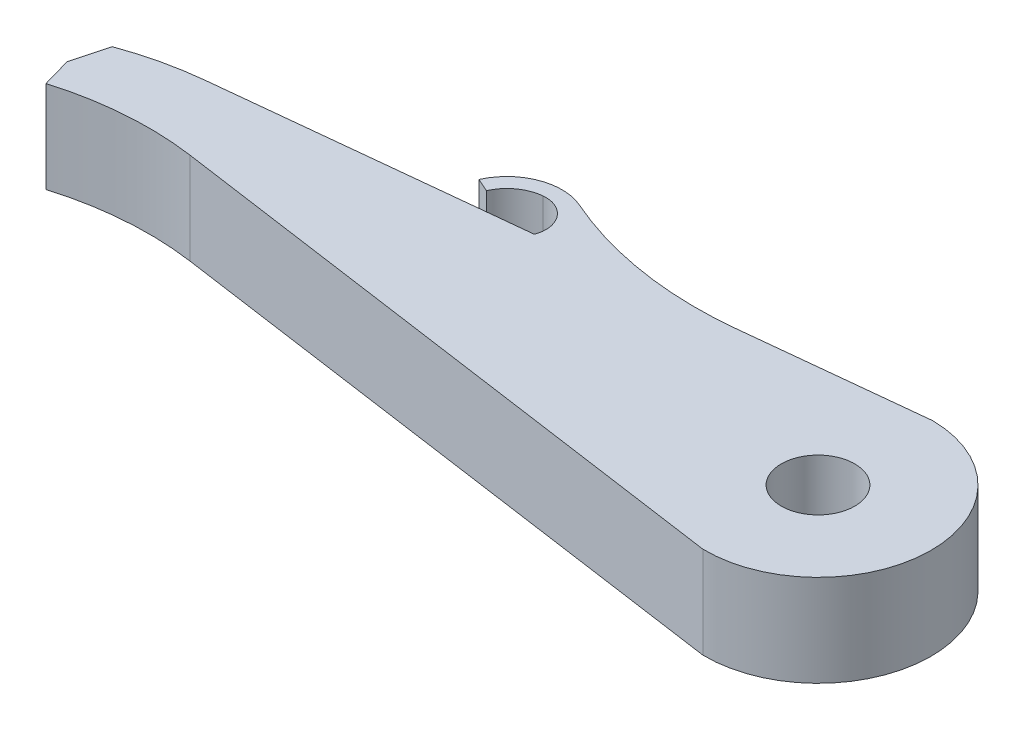
ISO-10303-21;
HEADER;
FILE_DESCRIPTION(('STEP AP214'),'2;1');
FILE_NAME('part.step','',(''),(''),'','','');
FILE_SCHEMA(('AUTOMOTIVE_DESIGN { 1 0 10303 214 1 1 1 1 }'));
ENDSEC;
DATA;
#1=APPLICATION_CONTEXT('core data for automotive mechanical design processes');
#2=APPLICATION_PROTOCOL_DEFINITION('international standard','automotive_design',2000,#1);
#3=PRODUCT_CONTEXT('',#1,'mechanical');
#4=PRODUCT('Part','Part','',(#3));
#5=PRODUCT_RELATED_PRODUCT_CATEGORY('part','',(#4));
#6=PRODUCT_DEFINITION_FORMATION('','',#4);
#7=PRODUCT_DEFINITION_CONTEXT('part definition',#1,'design');
#8=PRODUCT_DEFINITION('design','',#6,#7);
#9=PRODUCT_DEFINITION_SHAPE('','',#8);
#10=(LENGTH_UNIT() NAMED_UNIT(*) SI_UNIT(.MILLI.,.METRE.));
#11=(NAMED_UNIT(*) PLANE_ANGLE_UNIT() SI_UNIT($,.RADIAN.));
#12=(NAMED_UNIT(*) SI_UNIT($,.STERADIAN.) SOLID_ANGLE_UNIT());
#13=UNCERTAINTY_MEASURE_WITH_UNIT(LENGTH_MEASURE(1.E-05),#10,'distance_accuracy_value','');
#14=(GEOMETRIC_REPRESENTATION_CONTEXT(3) GLOBAL_UNCERTAINTY_ASSIGNED_CONTEXT((#13)) GLOBAL_UNIT_ASSIGNED_CONTEXT((#10,
#11,#12)) REPRESENTATION_CONTEXT('',''));
#15=CARTESIAN_POINT('',(0.,0.,0.));
#16=DIRECTION('',(0.,0.,1.));
#17=DIRECTION('',(1.,0.,0.));
#18=AXIS2_PLACEMENT_3D('',#15,#16,#17);
#19=CARTESIAN_POINT('',(8.06960821075852,2.5,-18.1095067362773));
#20=DIRECTION('',(-0.40702018513425,0.,0.913419163852654));
#21=DIRECTION('',(0.913419163852654,0.,0.40702018513425));
#22=AXIS2_PLACEMENT_3D('',#19,#20,#21);
#23=PLANE('',#22);
#24=DIRECTION('',(-0.913419163852653,0.,-0.40702018513425));
#25=VECTOR('',#24,1.);
#26=CARTESIAN_POINT('',(8.06960821075852,0.,-18.1095067362773));
#27=LINE('',#26,#25);
#28=CARTESIAN_POINT('',(12.3776456719996,0.,-16.1898423867318));
#29=VERTEX_POINT('',#28);
#30=CARTESIAN_POINT('',(12.0122780064586,0.,-16.3526504607855));
#31=VERTEX_POINT('',#30);
#32=EDGE_CURVE('E226',#29,#31,#27,.T.);
#33=ORIENTED_EDGE('',*,*,#32,.F.);
#34=DIRECTION('',(0.,-1.,0.));
#35=VECTOR('',#34,1.);
#36=CARTESIAN_POINT('',(12.3776456719996,2.5,-16.1898423867318));
#37=LINE('',#36,#35);
#38=CARTESIAN_POINT('',(12.3776456719996,2.5,-16.1898423867318));
#39=VERTEX_POINT('',#38);
#40=EDGE_CURVE('E172',#39,#29,#37,.T.);
#41=ORIENTED_EDGE('',*,*,#40,.F.);
#42=DIRECTION('',(-0.913419163852653,0.,-0.40702018513425));
#43=VECTOR('',#42,1.);
#44=CARTESIAN_POINT('',(8.06960821075852,2.5,-18.1095067362773));
#45=LINE('',#44,#43);
#46=CARTESIAN_POINT('',(12.0122780064586,2.5,-16.3526504607855));
#47=VERTEX_POINT('',#46);
#48=EDGE_CURVE('E201',#39,#47,#45,.T.);
#49=ORIENTED_EDGE('',*,*,#48,.T.);
#50=DIRECTION('',(0.,-1.,0.));
#51=VECTOR('',#50,1.);
#52=CARTESIAN_POINT('',(12.0122780064586,2.5,-16.3526504607855));
#53=LINE('',#52,#51);
#54=EDGE_CURVE('E194',#47,#31,#53,.T.);
#55=ORIENTED_EDGE('',*,*,#54,.T.);
#56=EDGE_LOOP('',(#33,#41,#49,#55));
#57=FACE_BOUND('',#56,.T.);
#58=ADVANCED_FACE('F37',(#57),#23,.T.);
#59=CARTESIAN_POINT('',(13.3824067522375,2.5,-15.7421201830844));
#60=DIRECTION('',(0.,-1.,0.));
#61=DIRECTION('',(0.,0.,-1.));
#62=AXIS2_PLACEMENT_3D('',#59,#60,#61);
#63=CYLINDRICAL_SURFACE('',#62,1.09999999999993);
#64=CARTESIAN_POINT('',(13.3824067522375,0.,-15.7421201830844));
#65=DIRECTION('',(0.,1.,0.));
#66=DIRECTION('',(0.,0.,1.));
#67=AXIS2_PLACEMENT_3D('',#64,#65,#66);
#68=CIRCLE('',#67,1.09999999999993);
#69=CARTESIAN_POINT('',(13.2677650143158,0.,-16.8361299051282));
#70=VERTEX_POINT('',#69);
#71=EDGE_CURVE('E224',#29,#70,#68,.F.);
#72=ORIENTED_EDGE('',*,*,#71,.T.);
#73=DIRECTION('',(0.,-1.,0.));
#74=VECTOR('',#73,1.);
#75=CARTESIAN_POINT('',(13.2677650143158,2.5,-16.8361299051282));
#76=LINE('',#75,#74);
#77=CARTESIAN_POINT('',(13.2677650143158,2.5,-16.8361299051282));
#78=VERTEX_POINT('',#77);
#79=EDGE_CURVE('E175',#78,#70,#76,.T.);
#80=ORIENTED_EDGE('',*,*,#79,.F.);
#81=CARTESIAN_POINT('',(13.3824067522375,2.5,-15.7421201830844));
#82=DIRECTION('',(0.,1.,0.));
#83=DIRECTION('',(0.,0.,1.));
#84=AXIS2_PLACEMENT_3D('',#81,#82,#83);
#85=CIRCLE('',#84,1.09999999999993);
#86=EDGE_CURVE('E244',#39,#78,#85,.F.);
#87=ORIENTED_EDGE('',*,*,#86,.F.);
#88=ORIENTED_EDGE('',*,*,#40,.T.);
#89=EDGE_LOOP('',(#72,#80,#87,#88));
#90=FACE_BOUND('',#89,.T.);
#91=ADVANCED_FACE('F269',(#90),#63,.F.);
#92=CARTESIAN_POINT('',(13.3469720332435,2.5,-16.0802686426252));
#93=DIRECTION('',(0.,-1.,0.));
#94=DIRECTION('',(0.,0.,-1.));
#95=AXIS2_PLACEMENT_3D('',#92,#93,#94);
#96=CYLINDRICAL_SURFACE('',#95,0.759999999999999);
#97=CARTESIAN_POINT('',(13.3469720332435,0.,-16.0802686426252));
#98=DIRECTION('',(0.,1.,0.));
#99=DIRECTION('',(0.,0.,1.));
#100=AXIS2_PLACEMENT_3D('',#97,#98,#99);
#101=CIRCLE('',#100,0.759999999999999);
#102=CARTESIAN_POINT('',(14.0584110920629,0.,-15.8129589615691));
#103=VERTEX_POINT('',#102);
#104=EDGE_CURVE('E221',#103,#70,#101,.T.);
#105=ORIENTED_EDGE('',*,*,#104,.F.);
#106=DIRECTION('',(0.,-1.,0.));
#107=VECTOR('',#106,1.);
#108=CARTESIAN_POINT('',(14.0584110920629,2.5,-15.8129589615691));
#109=LINE('',#108,#107);
#110=CARTESIAN_POINT('',(14.0584110920629,2.5,-15.8129589615691));
#111=VERTEX_POINT('',#110);
#112=EDGE_CURVE('E180',#111,#103,#109,.T.);
#113=ORIENTED_EDGE('',*,*,#112,.F.);
#114=CARTESIAN_POINT('',(13.3469720332435,2.5,-16.0802686426252));
#115=DIRECTION('',(0.,1.,0.));
#116=DIRECTION('',(0.,0.,1.));
#117=AXIS2_PLACEMENT_3D('',#114,#115,#116);
#118=CIRCLE('',#117,0.759999999999999);
#119=EDGE_CURVE('E241',#111,#78,#118,.T.);
#120=ORIENTED_EDGE('',*,*,#119,.T.);
#121=ORIENTED_EDGE('',*,*,#79,.T.);
#122=EDGE_LOOP('',(#105,#113,#120,#121));
#123=FACE_BOUND('',#122,.T.);
#124=ADVANCED_FACE('F266',(#123),#96,.F.);
#125=CARTESIAN_POINT('',(-1.48634909619356,2.5,-14.1840170174072));
#126=DIRECTION('',(-0.104219761747012,0.,-0.994554292767065));
#127=DIRECTION('',(-0.994554292767065,0.,0.104219761747012));
#128=AXIS2_PLACEMENT_3D('',#125,#126,#127);
#129=PLANE('',#128);
#130=DIRECTION('',(0.994554292767065,0.,-0.104219761747012));
#131=VECTOR('',#130,1.);
#132=CARTESIAN_POINT('',(-1.48634909619356,0.,-14.1840170174072));
#133=LINE('',#132,#131);
#134=CARTESIAN_POINT('',(5.92324955648456,0.,-14.9604719699816));
#135=VERTEX_POINT('',#134);
#136=EDGE_CURVE('E218',#135,#103,#133,.T.);
#137=ORIENTED_EDGE('',*,*,#136,.F.);
#138=DIRECTION('',(0.,-1.,0.));
#139=VECTOR('',#138,1.);
#140=CARTESIAN_POINT('',(5.92324955648456,2.5,-14.9604719699816));
#141=LINE('',#140,#139);
#142=CARTESIAN_POINT('',(5.92324955648456,2.5,-14.9604719699816));
#143=VERTEX_POINT('',#142);
#144=EDGE_CURVE('E184',#143,#135,#141,.T.);
#145=ORIENTED_EDGE('',*,*,#144,.F.);
#146=DIRECTION('',(0.994554292767065,0.,-0.104219761747012));
#147=VECTOR('',#146,1.);
#148=CARTESIAN_POINT('',(-1.48634909619356,2.5,-14.1840170174072));
#149=LINE('',#148,#147);
#150=EDGE_CURVE('E238',#143,#111,#149,.T.);
#151=ORIENTED_EDGE('',*,*,#150,.T.);
#152=ORIENTED_EDGE('',*,*,#112,.T.);
#153=EDGE_LOOP('',(#137,#145,#151,#152));
#154=FACE_BOUND('',#153,.T.);
#155=ADVANCED_FACE('F262',(#154),#129,.T.);
#156=CARTESIAN_POINT('',(6.81535807850737,2.5,-6.44720783159745));
#157=DIRECTION('',(0.,-1.,0.));
#158=DIRECTION('',(0.,0.,-1.));
#159=AXIS2_PLACEMENT_3D('',#156,#157,#158);
#160=CYLINDRICAL_SURFACE('',#159,8.55987873190752);
#161=CARTESIAN_POINT('',(6.81535807850737,0.,-6.44720783159745));
#162=DIRECTION('',(0.,1.,0.));
#163=DIRECTION('',(0.,0.,1.));
#164=AXIS2_PLACEMENT_3D('',#161,#162,#163);
#165=CIRCLE('',#164,8.55987873190752);
#166=CARTESIAN_POINT('',(3.88228567653783,0.,-14.488887394336));
#167=VERTEX_POINT('',#166);
#168=EDGE_CURVE('E215',#167,#135,#165,.F.);
#169=ORIENTED_EDGE('',*,*,#168,.F.);
#170=DIRECTION('',(0.,-1.,0.));
#171=VECTOR('',#170,1.);
#172=CARTESIAN_POINT('',(3.88228567653783,2.5,-14.488887394336));
#173=LINE('',#172,#171);
#174=CARTESIAN_POINT('',(3.88228567653783,2.5,-14.488887394336));
#175=VERTEX_POINT('',#174);
#176=EDGE_CURVE('E186',#175,#167,#173,.T.);
#177=ORIENTED_EDGE('',*,*,#176,.F.);
#178=CARTESIAN_POINT('',(6.81535807850737,2.5,-6.44720783159745));
#179=DIRECTION('',(0.,1.,0.));
#180=DIRECTION('',(0.,0.,1.));
#181=AXIS2_PLACEMENT_3D('',#178,#179,#180);
#182=CIRCLE('',#181,8.55987873190752);
#183=EDGE_CURVE('E159',#175,#143,#182,.F.);
#184=ORIENTED_EDGE('',*,*,#183,.T.);
#185=ORIENTED_EDGE('',*,*,#144,.T.);
#186=EDGE_LOOP('',(#169,#177,#184,#185));
#187=FACE_BOUND('',#186,.T.);
#188=ADVANCED_FACE('F258',(#187),#160,.T.);
#189=CARTESIAN_POINT('',(0.,2.5,0.));
#190=DIRECTION('',(0.965925826289068,0.,0.258819045102522));
#191=DIRECTION('',(0.258819045102522,0.,-0.965925826289068));
#192=AXIS2_PLACEMENT_3D('',#189,#190,#191);
#193=PLANE('',#192);
#194=DIRECTION('',(-0.258819045102522,0.,0.965925826289068));
#195=VECTOR('',#194,1.);
#196=CARTESIAN_POINT('',(0.,0.,0.));
#197=LINE('',#196,#195);
#198=CARTESIAN_POINT('',(3.6234666314353,0.,-13.522961568047));
#199=VERTEX_POINT('',#198);
#200=EDGE_CURVE('E213',#167,#199,#197,.T.);
#201=ORIENTED_EDGE('',*,*,#200,.T.);
#202=DIRECTION('',(0.,1.,0.));
#203=VECTOR('',#202,1.);
#204=CARTESIAN_POINT('',(3.6234666314353,-7.5,-13.522961568047));
#205=LINE('',#204,#203);
#206=CARTESIAN_POINT('',(3.6234666314353,2.5,-13.522961568047));
#207=VERTEX_POINT('',#206);
#208=EDGE_CURVE('E139',#199,#207,#205,.T.);
#209=ORIENTED_EDGE('',*,*,#208,.T.);
#210=DIRECTION('',(-0.258819045102522,0.,0.965925826289068));
#211=VECTOR('',#210,1.);
#212=CARTESIAN_POINT('',(0.,2.5,0.));
#213=LINE('',#212,#211);
#214=EDGE_CURVE('E149',#175,#207,#213,.T.);
#215=ORIENTED_EDGE('',*,*,#214,.F.);
#216=ORIENTED_EDGE('',*,*,#176,.T.);
#217=EDGE_LOOP('',(#201,#209,#215,#216));
#218=FACE_BOUND('',#217,.T.);
#219=ADVANCED_FACE('F253',(#218),#193,.F.);
#220=CARTESIAN_POINT('',(6.29771998830233,2.5,-4.51535617901932));
#221=DIRECTION('',(0.,-1.,0.));
#222=DIRECTION('',(0.,0.,-1.));
#223=AXIS2_PLACEMENT_3D('',#220,#221,#222);
#224=CYLINDRICAL_SURFACE('',#223,8.55987873190751);
#225=CARTESIAN_POINT('',(6.29771998830233,2.5,-4.51535617901932));
#226=DIRECTION('',(0.,1.,0.));
#227=DIRECTION('',(0.,0.,1.));
#228=AXIS2_PLACEMENT_3D('',#225,#226,#227);
#229=CIRCLE('',#228,8.55987873190751);
#230=CARTESIAN_POINT('',(3.8519480644686,2.5,-12.718387545627));
#231=VERTEX_POINT('',#230);
#232=CARTESIAN_POINT('',(7.50000000000002,2.5,-12.9903810567666));
#233=VERTEX_POINT('',#232);
#234=EDGE_CURVE('E145',#231,#233,#229,.F.);
#235=ORIENTED_EDGE('',*,*,#234,.F.);
#236=DIRECTION('',(0.,1.,0.));
#237=VECTOR('',#236,1.);
#238=CARTESIAN_POINT('',(3.8519480644686,-7.5,-12.718387545627));
#239=LINE('',#238,#237);
#240=CARTESIAN_POINT('',(3.8519480644686,0.,-12.718387545627));
#241=VERTEX_POINT('',#240);
#242=EDGE_CURVE('E129',#241,#231,#239,.T.);
#243=ORIENTED_EDGE('',*,*,#242,.F.);
#244=CARTESIAN_POINT('',(6.29771998830233,0.,-4.51535617901932));
#245=DIRECTION('',(0.,1.,0.));
#246=DIRECTION('',(0.,0.,1.));
#247=AXIS2_PLACEMENT_3D('',#244,#245,#246);
#248=CIRCLE('',#247,8.55987873190751);
#249=CARTESIAN_POINT('',(7.50000000000002,0.,-12.9903810567666));
#250=VERTEX_POINT('',#249);
#251=EDGE_CURVE('E211',#241,#250,#248,.F.);
#252=ORIENTED_EDGE('',*,*,#251,.T.);
#253=DIRECTION('',(0.,-1.,0.));
#254=VECTOR('',#253,1.);
#255=CARTESIAN_POINT('',(7.50000000000002,2.5,-12.9903810567666));
#256=LINE('',#255,#254);
#257=EDGE_CURVE('E153',#233,#250,#256,.T.);
#258=ORIENTED_EDGE('',*,*,#257,.F.);
#259=EDGE_LOOP('',(#235,#243,#252,#258));
#260=FACE_BOUND('',#259,.T.);
#261=ADVANCED_FACE('F151',(#260),#224,.F.);
#262=CARTESIAN_POINT('',(1.95443809378865,2.5,-13.7770829637989));
#263=DIRECTION('',(0.140455262200863,0.,-0.990087026134616));
#264=DIRECTION('',(-0.990087026134616,0.,-0.140455262200863));
#265=AXIS2_PLACEMENT_3D('',#262,#263,#264);
#266=PLANE('',#265);
#267=DIRECTION('',(0.990087026134616,0.,0.140455262200863));
#268=VECTOR('',#267,1.);
#269=CARTESIAN_POINT('',(1.95443809378865,0.,-13.7770829637989));
#270=LINE('',#269,#268);
#271=CARTESIAN_POINT('',(23.7805143183467,0.,-10.6808023561187));
#272=VERTEX_POINT('',#271);
#273=EDGE_CURVE('E208',#250,#272,#270,.T.);
#274=ORIENTED_EDGE('',*,*,#273,.T.);
#275=DIRECTION('',(0.,-1.,0.));
#276=VECTOR('',#275,1.);
#277=CARTESIAN_POINT('',(23.7805143183467,2.5,-10.6808023561187));
#278=LINE('',#277,#276);
#279=CARTESIAN_POINT('',(23.7805143183467,2.5,-10.6808023561187));
#280=VERTEX_POINT('',#279);
#281=EDGE_CURVE('E189',#280,#272,#278,.T.);
#282=ORIENTED_EDGE('',*,*,#281,.F.);
#283=DIRECTION('',(0.990087026134616,0.,0.140455262200863));
#284=VECTOR('',#283,1.);
#285=CARTESIAN_POINT('',(1.95443809378865,2.5,-13.7770829637989));
#286=LINE('',#285,#284);
#287=EDGE_CURVE('E155',#233,#280,#286,.T.);
#288=ORIENTED_EDGE('',*,*,#287,.F.);
#289=ORIENTED_EDGE('',*,*,#257,.T.);
#290=EDGE_LOOP('',(#274,#282,#288,#289));
#291=FACE_BOUND('',#290,.T.);
#292=ADVANCED_FACE('F285',(#291),#266,.F.);
#293=CARTESIAN_POINT('',(23.836773762309,2.5,-13.7621677482813));
#294=DIRECTION('',(0.,-1.,0.));
#295=DIRECTION('',(0.,0.,-1.));
#296=AXIS2_PLACEMENT_3D('',#293,#294,#295);
#297=CYLINDRICAL_SURFACE('',#296,3.08187894068731);
#298=CARTESIAN_POINT('',(23.836773762309,0.,-13.7621677482813));
#299=DIRECTION('',(0.,1.,0.));
#300=DIRECTION('',(0.,0.,1.));
#301=AXIS2_PLACEMENT_3D('',#298,#299,#300);
#302=CIRCLE('',#301,3.08187894068731);
#303=CARTESIAN_POINT('',(23.8930332062714,0.,-16.8435331404438));
#304=VERTEX_POINT('',#303);
#305=EDGE_CURVE('E205',#304,#272,#302,.F.);
#306=ORIENTED_EDGE('',*,*,#305,.F.);
#307=DIRECTION('',(0.,-1.,0.));
#308=VECTOR('',#307,1.);
#309=CARTESIAN_POINT('',(23.8930332062714,2.5,-16.8435331404438));
#310=LINE('',#309,#308);
#311=CARTESIAN_POINT('',(23.8930332062714,2.5,-16.8435331404438));
#312=VERTEX_POINT('',#311);
#313=EDGE_CURVE('E191',#312,#304,#310,.T.);
#314=ORIENTED_EDGE('',*,*,#313,.F.);
#315=CARTESIAN_POINT('',(23.836773762309,2.5,-13.7621677482813));
#316=DIRECTION('',(0.,1.,0.));
#317=DIRECTION('',(0.,0.,1.));
#318=AXIS2_PLACEMENT_3D('',#315,#316,#317);
#319=CIRCLE('',#318,3.08187894068731);
#320=EDGE_CURVE('E157',#312,#280,#319,.F.);
#321=ORIENTED_EDGE('',*,*,#320,.T.);
#322=ORIENTED_EDGE('',*,*,#281,.T.);
#323=EDGE_LOOP('',(#306,#314,#321,#322));
#324=FACE_BOUND('',#323,.T.);
#325=ADVANCED_FACE('F288',(#324),#297,.T.);
#326=CARTESIAN_POINT('',(19.0303894257842,0.,-16.3339746578667));
#327=VERTEX_POINT('',#326);
#328=EDGE_CURVE('E204',#327,#304,#133,.T.);
#329=ORIENTED_EDGE('',*,*,#328,.F.);
#330=DIRECTION('',(0.,-1.,0.));
#331=VECTOR('',#330,1.);
#332=CARTESIAN_POINT('',(19.0303894257842,2.5,-16.3339746578666));
#333=LINE('',#332,#331);
#334=CARTESIAN_POINT('',(19.0303894257842,2.5,-16.3339746578667));
#335=VERTEX_POINT('',#334);
#336=EDGE_CURVE('E52',#327,#335,#333,.F.);
#337=ORIENTED_EDGE('',*,*,#336,.T.);
#338=EDGE_CURVE('E233',#335,#312,#149,.T.);
#339=ORIENTED_EDGE('',*,*,#338,.T.);
#340=ORIENTED_EDGE('',*,*,#313,.T.);
#341=EDGE_LOOP('',(#329,#337,#339,#340));
#342=FACE_BOUND('',#341,.T.);
#343=ADVANCED_FACE('F292',(#342),#129,.T.);
#344=CARTESIAN_POINT('',(13.3824067522375,2.5,-15.7421201830844));
#345=DIRECTION('',(0.,-1.,0.));
#346=DIRECTION('',(0.,0.,-1.));
#347=AXIS2_PLACEMENT_3D('',#344,#345,#346);
#348=CYLINDRICAL_SURFACE('',#347,1.49999999999993);
#349=CARTESIAN_POINT('',(13.3824067522375,2.5,-15.7421201830844));
#350=DIRECTION('',(0.,1.,0.));
#351=DIRECTION('',(0.,0.,1.));
#352=AXIS2_PLACEMENT_3D('',#349,#350,#351);
#353=CIRCLE('',#352,1.49999999999993);
#354=CARTESIAN_POINT('',(13.9831613247692,2.5,-17.1165633225348));
#355=VERTEX_POINT('',#354);
#356=EDGE_CURVE('E231',#355,#47,#353,.T.);
#357=ORIENTED_EDGE('',*,*,#356,.F.);
#358=DIRECTION('',(0.,-1.,0.));
#359=VECTOR('',#358,1.);
#360=CARTESIAN_POINT('',(13.9831613247692,2.5,-17.1165633225348));
#361=LINE('',#360,#359);
#362=CARTESIAN_POINT('',(13.9831613247692,0.,-17.1165633225348));
#363=VERTEX_POINT('',#362);
#364=EDGE_CURVE('E166',#355,#363,#361,.T.);
#365=ORIENTED_EDGE('',*,*,#364,.T.);
#366=CARTESIAN_POINT('',(13.3824067522375,0.,-15.7421201830844));
#367=DIRECTION('',(0.,1.,0.));
#368=DIRECTION('',(0.,0.,1.));
#369=AXIS2_PLACEMENT_3D('',#366,#367,#368);
#370=CIRCLE('',#369,1.49999999999993);
#371=EDGE_CURVE('E202',#363,#31,#370,.T.);
#372=ORIENTED_EDGE('',*,*,#371,.T.);
#373=ORIENTED_EDGE('',*,*,#54,.F.);
#374=EDGE_LOOP('',(#357,#365,#372,#373));
#375=FACE_BOUND('',#374,.T.);
#376=ADVANCED_FACE('F296',(#375),#348,.T.);
#377=CARTESIAN_POINT('',(23.836773762309,2.5,-13.7621677482813));
#378=DIRECTION('',(0.,-1.,0.));
#379=DIRECTION('',(0.,0.,-1.));
#380=AXIS2_PLACEMENT_3D('',#377,#378,#379);
#381=CYLINDRICAL_SURFACE('',#380,0.999999999999998);
#382=CARTESIAN_POINT('',(23.836773762309,2.5,-13.7621677482813));
#383=DIRECTION('',(0.,1.,0.));
#384=DIRECTION('',(0.,0.,1.));
#385=AXIS2_PLACEMENT_3D('',#382,#383,#384);
#386=CIRCLE('',#385,0.999999999999998);
#387=CARTESIAN_POINT('',(23.836773762309,2.5,-12.7621677482813));
#388=VERTEX_POINT('',#387);
#389=EDGE_CURVE('E197',#388,#388,#386,.T.);
#390=ORIENTED_EDGE('',*,*,#389,.T.);
#391=EDGE_LOOP('',(#390));
#392=FACE_BOUND('',#391,.T.);
#393=CARTESIAN_POINT('',(23.836773762309,0.,-13.7621677482813));
#394=DIRECTION('',(0.,1.,0.));
#395=DIRECTION('',(0.,0.,1.));
#396=AXIS2_PLACEMENT_3D('',#393,#394,#395);
#397=CIRCLE('',#396,0.999999999999998);
#398=CARTESIAN_POINT('',(23.836773762309,0.,-12.7621677482813));
#399=VERTEX_POINT('',#398);
#400=EDGE_CURVE('E198',#399,#399,#397,.T.);
#401=ORIENTED_EDGE('',*,*,#400,.F.);
#402=EDGE_LOOP('',(#401));
#403=FACE_BOUND('',#402,.T.);
#404=ADVANCED_FACE('F299',(#392,#403),#381,.F.);
#405=CARTESIAN_POINT('',(0.,2.5,0.));
#406=DIRECTION('',(0.,1.,0.));
#407=DIRECTION('',(0.,0.,1.));
#408=AXIS2_PLACEMENT_3D('',#405,#406,#407);
#409=PLANE('',#408);
#410=DIRECTION('',(-0.273176708736756,0.,-0.961963869281874));
#411=VECTOR('',#410,1.);
#412=CARTESIAN_POINT('',(3.6234666314353,2.5,-13.522961568047));
#413=LINE('',#412,#411);
#414=EDGE_CURVE('E132',#231,#207,#413,.T.);
#415=ORIENTED_EDGE('',*,*,#414,.F.);
#416=ORIENTED_EDGE('',*,*,#234,.T.);
#417=ORIENTED_EDGE('',*,*,#287,.T.);
#418=ORIENTED_EDGE('',*,*,#320,.F.);
#419=ORIENTED_EDGE('',*,*,#338,.F.);
#420=CARTESIAN_POINT('',(17.9881918083141,2.5,-26.2795175855373));
#421=DIRECTION('',(0.,1.,0.));
#422=DIRECTION('',(0.,0.,1.));
#423=AXIS2_PLACEMENT_3D('',#420,#421,#422);
#424=CIRCLE('',#423,10.);
#425=EDGE_CURVE('E11',#335,#355,#424,.F.);
#426=ORIENTED_EDGE('',*,*,#425,.T.);
#427=ORIENTED_EDGE('',*,*,#356,.T.);
#428=ORIENTED_EDGE('',*,*,#48,.F.);
#429=ORIENTED_EDGE('',*,*,#86,.T.);
#430=ORIENTED_EDGE('',*,*,#119,.F.);
#431=ORIENTED_EDGE('',*,*,#150,.F.);
#432=ORIENTED_EDGE('',*,*,#183,.F.);
#433=ORIENTED_EDGE('',*,*,#214,.T.);
#434=EDGE_LOOP('',(#415,#416,#417,#418,#419,#426,#427,#428,#429,#430,#431,#432,#433));
#435=FACE_BOUND('',#434,.T.);
#436=ORIENTED_EDGE('',*,*,#389,.F.);
#437=EDGE_LOOP('',(#436));
#438=FACE_BOUND('',#437,.T.);
#439=ADVANCED_FACE('F143',(#435,#438),#409,.T.);
#440=CARTESIAN_POINT('',(0.,0.,0.));
#441=DIRECTION('',(0.,1.,0.));
#442=DIRECTION('',(0.,0.,1.));
#443=AXIS2_PLACEMENT_3D('',#440,#441,#442);
#444=PLANE('',#443);
#445=ORIENTED_EDGE('',*,*,#251,.F.);
#446=DIRECTION('',(-0.273176708736756,0.,-0.961963869281874));
#447=VECTOR('',#446,1.);
#448=CARTESIAN_POINT('',(6.90671022276373,0.,-1.96135471102631));
#449=LINE('',#448,#447);
#450=EDGE_CURVE('E135',#241,#199,#449,.T.);
#451=ORIENTED_EDGE('',*,*,#450,.T.);
#452=ORIENTED_EDGE('',*,*,#200,.F.);
#453=ORIENTED_EDGE('',*,*,#168,.T.);
#454=ORIENTED_EDGE('',*,*,#136,.T.);
#455=ORIENTED_EDGE('',*,*,#104,.T.);
#456=ORIENTED_EDGE('',*,*,#71,.F.);
#457=ORIENTED_EDGE('',*,*,#32,.T.);
#458=ORIENTED_EDGE('',*,*,#371,.F.);
#459=CARTESIAN_POINT('',(17.9881918083141,0.,-26.2795175855373));
#460=DIRECTION('',(0.,1.,0.));
#461=DIRECTION('',(0.,0.,1.));
#462=AXIS2_PLACEMENT_3D('',#459,#460,#461);
#463=CIRCLE('',#462,10.);
#464=EDGE_CURVE('E45',#363,#327,#463,.T.);
#465=ORIENTED_EDGE('',*,*,#464,.T.);
#466=ORIENTED_EDGE('',*,*,#328,.T.);
#467=ORIENTED_EDGE('',*,*,#305,.T.);
#468=ORIENTED_EDGE('',*,*,#273,.F.);
#469=EDGE_LOOP('',(#445,#451,#452,#453,#454,#455,#456,#457,#458,#465,#466,#467,#468));
#470=FACE_BOUND('',#469,.T.);
#471=ORIENTED_EDGE('',*,*,#400,.T.);
#472=EDGE_LOOP('',(#471));
#473=FACE_BOUND('',#472,.T.);
#474=ADVANCED_FACE('F255',(#470,#473),#444,.F.);
#475=CARTESIAN_POINT('',(3.6234666314353,-7.5,-13.522961568047));
#476=DIRECTION('',(0.961963869281874,0.,-0.273176708736756));
#477=DIRECTION('',(-0.273176708736756,0.,-0.961963869281874));
#478=AXIS2_PLACEMENT_3D('',#475,#476,#477);
#479=PLANE('',#478);
#480=ORIENTED_EDGE('',*,*,#242,.T.);
#481=ORIENTED_EDGE('',*,*,#414,.T.);
#482=ORIENTED_EDGE('',*,*,#208,.F.);
#483=ORIENTED_EDGE('',*,*,#450,.F.);
#484=EDGE_LOOP('',(#480,#481,#482,#483));
#485=FACE_BOUND('',#484,.T.);
#486=ADVANCED_FACE('F131',(#485),#479,.F.);
#487=CARTESIAN_POINT('',(17.9881918083141,2.5,-26.2795175855373));
#488=DIRECTION('',(0.,-1.,0.));
#489=DIRECTION('',(0.,0.,-1.));
#490=AXIS2_PLACEMENT_3D('',#487,#488,#489);
#491=CYLINDRICAL_SURFACE('',#490,10.);
#492=ORIENTED_EDGE('',*,*,#425,.F.);
#493=ORIENTED_EDGE('',*,*,#336,.F.);
#494=ORIENTED_EDGE('',*,*,#464,.F.);
#495=ORIENTED_EDGE('',*,*,#364,.F.);
#496=EDGE_LOOP('',(#492,#493,#494,#495));
#497=FACE_BOUND('',#496,.T.);
#498=ADVANCED_FACE('F39',(#497),#491,.F.);
#499=CLOSED_SHELL('',(#58,#91,#124,#155,#188,#219,#261,#292,#325,#343,#376,#404,#439,#474,#486,#498));
#500=MANIFOLD_SOLID_BREP('B2',#499);
#501=ADVANCED_BREP_SHAPE_REPRESENTATION('',(#18,#500),#14);
#502=SHAPE_DEFINITION_REPRESENTATION(#9,#501);
ENDSEC;
END-ISO-10303-21;
